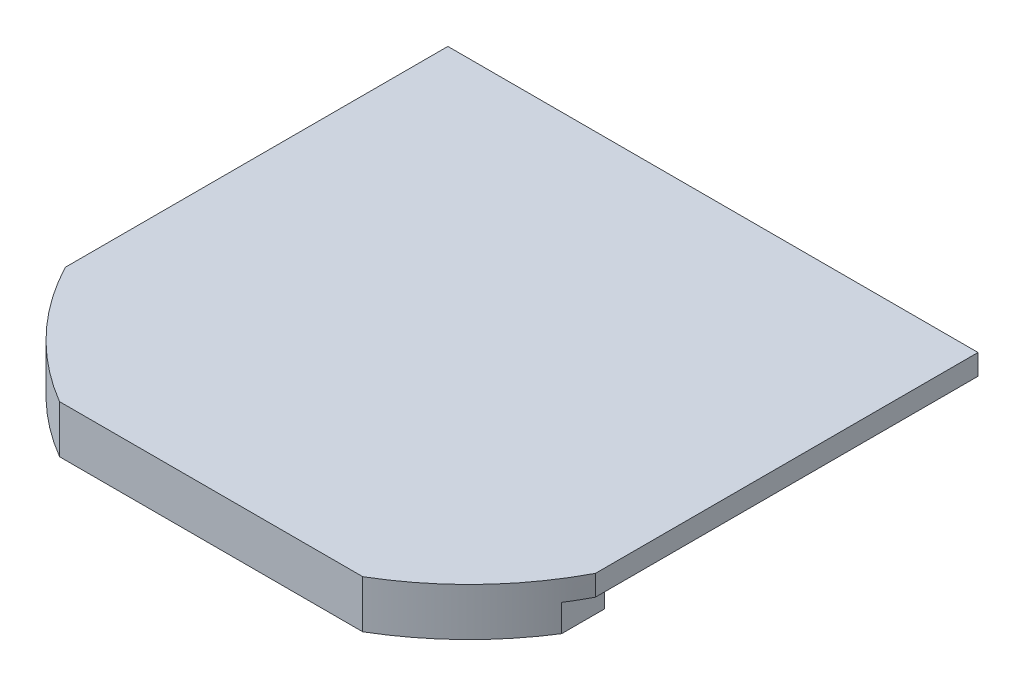
ISO-10303-21;
HEADER;
FILE_DESCRIPTION(('STEP AP214'),'2;1');
FILE_NAME('part.step','',(''),(''),'','','');
FILE_SCHEMA(('AUTOMOTIVE_DESIGN { 1 0 10303 214 1 1 1 1 }'));
ENDSEC;
DATA;
#1=APPLICATION_CONTEXT('core data for automotive mechanical design processes');
#2=APPLICATION_PROTOCOL_DEFINITION('international standard','automotive_design',2000,#1);
#3=PRODUCT_CONTEXT('',#1,'mechanical');
#4=PRODUCT('Part','Part','',(#3));
#5=PRODUCT_RELATED_PRODUCT_CATEGORY('part','',(#4));
#6=PRODUCT_DEFINITION_FORMATION('','',#4);
#7=PRODUCT_DEFINITION_CONTEXT('part definition',#1,'design');
#8=PRODUCT_DEFINITION('design','',#6,#7);
#9=PRODUCT_DEFINITION_SHAPE('','',#8);
#10=(LENGTH_UNIT() NAMED_UNIT(*) SI_UNIT(.MILLI.,.METRE.));
#11=(NAMED_UNIT(*) PLANE_ANGLE_UNIT() SI_UNIT($,.RADIAN.));
#12=(NAMED_UNIT(*) SI_UNIT($,.STERADIAN.) SOLID_ANGLE_UNIT());
#13=UNCERTAINTY_MEASURE_WITH_UNIT(LENGTH_MEASURE(1.E-05),#10,'distance_accuracy_value','');
#14=(GEOMETRIC_REPRESENTATION_CONTEXT(3) GLOBAL_UNCERTAINTY_ASSIGNED_CONTEXT((#13)) GLOBAL_UNIT_ASSIGNED_CONTEXT((#10,
#11,#12)) REPRESENTATION_CONTEXT('',''));
#15=CARTESIAN_POINT('',(0.,0.,0.));
#16=DIRECTION('',(0.,0.,1.));
#17=DIRECTION('',(1.,0.,0.));
#18=AXIS2_PLACEMENT_3D('',#15,#16,#17);
#19=CARTESIAN_POINT('',(-24.5,0.33,1.54680571791022));
#20=DIRECTION('',(1.,0.,0.));
#21=DIRECTION('',(0.,0.,-1.));
#22=AXIS2_PLACEMENT_3D('',#19,#20,#21);
#23=PLANE('',#22);
#24=DIRECTION('',(0.,0.,-1.));
#25=VECTOR('',#24,1.);
#26=CARTESIAN_POINT('',(-24.5,0.329999999999997,-9.12659714104491));
#27=LINE('',#26,#25);
#28=CARTESIAN_POINT('',(-24.5,0.329999999999997,5.71612064918291));
#29=VERTEX_POINT('',#28);
#30=CARTESIAN_POINT('',(-24.5,0.329999999999997,1.54680571791021));
#31=VERTEX_POINT('',#30);
#32=EDGE_CURVE('E168',#29,#31,#27,.T.);
#33=ORIENTED_EDGE('',*,*,#32,.T.);
#34=DIRECTION('',(0.,-1.,0.));
#35=VECTOR('',#34,1.);
#36=CARTESIAN_POINT('',(-24.5,0.33,1.54680571791021));
#37=LINE('',#36,#35);
#38=CARTESIAN_POINT('',(-24.5,-2.29999999999109,1.54680571791021));
#39=VERTEX_POINT('',#38);
#40=EDGE_CURVE('E252',#31,#39,#37,.T.);
#41=ORIENTED_EDGE('',*,*,#40,.T.);
#42=DIRECTION('',(0.,0.,-1.));
#43=VECTOR('',#42,1.);
#44=CARTESIAN_POINT('',(-24.5,-2.29999999999109,1.54680571791022));
#45=LINE('',#44,#43);
#46=CARTESIAN_POINT('',(-24.5,-2.29999999999109,5.71612064918291));
#47=VERTEX_POINT('',#46);
#48=EDGE_CURVE('E208',#47,#39,#45,.T.);
#49=ORIENTED_EDGE('',*,*,#48,.F.);
#50=DIRECTION('',(0.,-1.,0.));
#51=VECTOR('',#50,1.);
#52=CARTESIAN_POINT('',(-24.5,0.33,5.71612064918291));
#53=LINE('',#52,#51);
#54=EDGE_CURVE('E254',#29,#47,#53,.T.);
#55=ORIENTED_EDGE('',*,*,#54,.F.);
#56=EDGE_LOOP('',(#33,#41,#49,#55));
#57=FACE_BOUND('',#56,.T.);
#58=ADVANCED_FACE('F34',(#57),#23,.F.);
#59=CARTESIAN_POINT('',(24.5,0.33,5.71612064918292));
#60=DIRECTION('',(-1.,0.,0.));
#61=DIRECTION('',(0.,0.,1.));
#62=AXIS2_PLACEMENT_3D('',#59,#60,#61);
#63=PLANE('',#62);
#64=DIRECTION('',(0.,0.,1.));
#65=VECTOR('',#64,1.);
#66=CARTESIAN_POINT('',(24.5,0.329999999999997,-9.12659714104488));
#67=LINE('',#66,#65);
#68=CARTESIAN_POINT('',(24.5,0.329999999999997,1.54680571791023));
#69=VERTEX_POINT('',#68);
#70=CARTESIAN_POINT('',(24.5,0.329999999999997,5.71612064918292));
#71=VERTEX_POINT('',#70);
#72=EDGE_CURVE('E167',#69,#71,#67,.T.);
#73=ORIENTED_EDGE('',*,*,#72,.T.);
#74=DIRECTION('',(0.,-1.,0.));
#75=VECTOR('',#74,1.);
#76=CARTESIAN_POINT('',(24.5,0.33,5.71612064918292));
#77=LINE('',#76,#75);
#78=CARTESIAN_POINT('',(24.5,-2.29999999999109,5.71612064918292));
#79=VERTEX_POINT('',#78);
#80=EDGE_CURVE('E227',#71,#79,#77,.T.);
#81=ORIENTED_EDGE('',*,*,#80,.T.);
#82=DIRECTION('',(0.,0.,1.));
#83=VECTOR('',#82,1.);
#84=CARTESIAN_POINT('',(24.5,-2.29999999999109,5.71612064918292));
#85=LINE('',#84,#83);
#86=CARTESIAN_POINT('',(24.5,-2.29999999999109,1.54680571791023));
#87=VERTEX_POINT('',#86);
#88=EDGE_CURVE('E200',#87,#79,#85,.T.);
#89=ORIENTED_EDGE('',*,*,#88,.F.);
#90=DIRECTION('',(0.,-1.,0.));
#91=VECTOR('',#90,1.);
#92=CARTESIAN_POINT('',(24.5,0.33,1.54680571791023));
#93=LINE('',#92,#91);
#94=EDGE_CURVE('E232',#69,#87,#93,.T.);
#95=ORIENTED_EDGE('',*,*,#94,.F.);
#96=EDGE_LOOP('',(#73,#81,#89,#95));
#97=FACE_BOUND('',#96,.T.);
#98=ADVANCED_FACE('F261',(#97),#63,.F.);
#99=CARTESIAN_POINT('',(0.,0.33,-9.79999999999999));
#100=DIRECTION('',(0.,-1.,0.));
#101=DIRECTION('',(0.,0.,-1.));
#102=AXIS2_PLACEMENT_3D('',#99,#100,#101);
#103=CYLINDRICAL_SURFACE('',#102,27.);
#104=ORIENTED_EDGE('',*,*,#94,.T.);
#105=CARTESIAN_POINT('',(0.,-2.3,-9.79999999999999));
#106=DIRECTION('',(0.,-1.,0.));
#107=DIRECTION('',(0.,0.,1.));
#108=AXIS2_PLACEMENT_3D('',#105,#106,#107);
#109=CIRCLE('',#108,27.);
#110=CARTESIAN_POINT('',(14.142135623731,-2.29999999999109,13.2));
#111=VERTEX_POINT('',#110);
#112=EDGE_CURVE('E209',#87,#111,#109,.T.);
#113=ORIENTED_EDGE('',*,*,#112,.T.);
#114=DIRECTION('',(0.,-1.,0.));
#115=VECTOR('',#114,1.);
#116=CARTESIAN_POINT('',(14.142135623731,0.33,13.2));
#117=LINE('',#116,#115);
#118=CARTESIAN_POINT('',(14.142135623731,0.33,13.2));
#119=VERTEX_POINT('',#118);
#120=EDGE_CURVE('E11',#119,#111,#117,.T.);
#121=ORIENTED_EDGE('',*,*,#120,.F.);
#122=CARTESIAN_POINT('',(0.,0.33,-9.79999999999999));
#123=DIRECTION('',(0.,-1.,0.));
#124=DIRECTION('',(0.,0.,1.));
#125=AXIS2_PLACEMENT_3D('',#122,#123,#124);
#126=CIRCLE('',#125,27.);
#127=EDGE_CURVE('E203',#69,#119,#126,.T.);
#128=ORIENTED_EDGE('',*,*,#127,.F.);
#129=EDGE_LOOP('',(#104,#113,#121,#128));
#130=FACE_BOUND('',#129,.T.);
#131=ADVANCED_FACE('F36',(#130),#103,.F.);
#132=CARTESIAN_POINT('',(14.142135623731,0.33,13.2));
#133=DIRECTION('',(0.,0.,1.));
#134=DIRECTION('',(1.,0.,0.));
#135=AXIS2_PLACEMENT_3D('',#132,#133,#134);
#136=PLANE('',#135);
#137=ORIENTED_EDGE('',*,*,#120,.T.);
#138=DIRECTION('',(-1.,0.,0.));
#139=VECTOR('',#138,1.);
#140=CARTESIAN_POINT('',(14.142135623731,-2.3,13.2));
#141=LINE('',#140,#139);
#142=CARTESIAN_POINT('',(-14.142135623731,-2.29999999999109,13.2));
#143=VERTEX_POINT('',#142);
#144=EDGE_CURVE('E133',#111,#143,#141,.T.);
#145=ORIENTED_EDGE('',*,*,#144,.T.);
#146=DIRECTION('',(0.,-1.,0.));
#147=VECTOR('',#146,1.);
#148=CARTESIAN_POINT('',(-14.142135623731,0.33,13.2));
#149=LINE('',#148,#147);
#150=CARTESIAN_POINT('',(-14.142135623731,0.33,13.2));
#151=VERTEX_POINT('',#150);
#152=EDGE_CURVE('E43',#151,#143,#149,.T.);
#153=ORIENTED_EDGE('',*,*,#152,.F.);
#154=DIRECTION('',(-1.,0.,0.));
#155=VECTOR('',#154,1.);
#156=CARTESIAN_POINT('',(14.142135623731,0.33,13.2));
#157=LINE('',#156,#155);
#158=EDGE_CURVE('E54',#119,#151,#157,.T.);
#159=ORIENTED_EDGE('',*,*,#158,.F.);
#160=EDGE_LOOP('',(#137,#145,#153,#159));
#161=FACE_BOUND('',#160,.T.);
#162=ADVANCED_FACE('F244',(#161),#136,.F.);
#163=CARTESIAN_POINT('',(0.,0.33,-9.79999999999999));
#164=DIRECTION('',(0.,-1.,0.));
#165=DIRECTION('',(0.,0.,-1.));
#166=AXIS2_PLACEMENT_3D('',#163,#164,#165);
#167=CYLINDRICAL_SURFACE('',#166,27.);
#168=ORIENTED_EDGE('',*,*,#152,.T.);
#169=CARTESIAN_POINT('',(0.,-2.29999999999109,-9.79999999999999));
#170=DIRECTION('',(0.,1.,0.));
#171=DIRECTION('',(0.,0.,1.));
#172=AXIS2_PLACEMENT_3D('',#169,#170,#171);
#173=CIRCLE('',#172,27.);
#174=EDGE_CURVE('E205',#39,#143,#173,.T.);
#175=ORIENTED_EDGE('',*,*,#174,.F.);
#176=ORIENTED_EDGE('',*,*,#40,.F.);
#177=CARTESIAN_POINT('',(0.,0.33,-9.79999999999999));
#178=DIRECTION('',(0.,-1.,0.));
#179=DIRECTION('',(0.,0.,1.));
#180=AXIS2_PLACEMENT_3D('',#177,#178,#179);
#181=CIRCLE('',#180,27.);
#182=EDGE_CURVE('E224',#151,#31,#181,.T.);
#183=ORIENTED_EDGE('',*,*,#182,.F.);
#184=EDGE_LOOP('',(#168,#175,#176,#183));
#185=FACE_BOUND('',#184,.T.);
#186=ADVANCED_FACE('F251',(#185),#167,.F.);
#187=CARTESIAN_POINT('',(0.,0.33,-9.79999999999999));
#188=DIRECTION('',(0.,-1.,0.));
#189=DIRECTION('',(0.,0.,-1.));
#190=AXIS2_PLACEMENT_3D('',#187,#188,#189);
#191=CYLINDRICAL_SURFACE('',#190,29.);
#192=CARTESIAN_POINT('',(0.,2.33,-9.79999999999999));
#193=DIRECTION('',(0.,1.,0.));
#194=DIRECTION('',(0.,0.,1.));
#195=AXIS2_PLACEMENT_3D('',#192,#193,#194);
#196=CIRCLE('',#195,29.);
#197=CARTESIAN_POINT('',(-25.7,2.33,3.63540099885372));
#198=VERTEX_POINT('',#197);
#199=CARTESIAN_POINT('',(-14.6969384566991,2.33,15.2));
#200=VERTEX_POINT('',#199);
#201=EDGE_CURVE('E166',#198,#200,#196,.T.);
#202=ORIENTED_EDGE('',*,*,#201,.F.);
#203=DIRECTION('',(0.,1.,0.));
#204=VECTOR('',#203,1.);
#205=CARTESIAN_POINT('',(-25.7,-64.2934882390701,3.63540099885372));
#206=LINE('',#205,#204);
#207=CARTESIAN_POINT('',(-25.7,0.329999999999997,3.63540099885372));
#208=VERTEX_POINT('',#207);
#209=EDGE_CURVE('E158',#208,#198,#206,.T.);
#210=ORIENTED_EDGE('',*,*,#209,.F.);
#211=CARTESIAN_POINT('',(0.,0.329999999999997,-9.79999999999999));
#212=DIRECTION('',(0.,1.,0.));
#213=DIRECTION('',(0.,0.,1.));
#214=AXIS2_PLACEMENT_3D('',#211,#212,#213);
#215=CIRCLE('',#214,29.);
#216=EDGE_CURVE('E170',#29,#208,#215,.F.);
#217=ORIENTED_EDGE('',*,*,#216,.F.);
#218=ORIENTED_EDGE('',*,*,#54,.T.);
#219=CARTESIAN_POINT('',(0.,-2.29999999999109,-9.79999999999999));
#220=DIRECTION('',(0.,1.,0.));
#221=DIRECTION('',(0.,0.,1.));
#222=AXIS2_PLACEMENT_3D('',#219,#220,#221);
#223=CIRCLE('',#222,29.);
#224=CARTESIAN_POINT('',(-14.6969384566991,-2.29999999999109,15.2));
#225=VERTEX_POINT('',#224);
#226=EDGE_CURVE('E218',#225,#47,#223,.F.);
#227=ORIENTED_EDGE('',*,*,#226,.F.);
#228=DIRECTION('',(0.,-1.,0.));
#229=VECTOR('',#228,1.);
#230=CARTESIAN_POINT('',(-14.6969384566991,0.33,15.2));
#231=LINE('',#230,#229);
#232=EDGE_CURVE('E197',#200,#225,#231,.T.);
#233=ORIENTED_EDGE('',*,*,#232,.F.);
#234=EDGE_LOOP('',(#202,#210,#217,#218,#227,#233));
#235=FACE_BOUND('',#234,.T.);
#236=ADVANCED_FACE('F194',(#235),#191,.T.);
#237=CARTESIAN_POINT('',(14.6969384566991,0.33,15.2));
#238=DIRECTION('',(0.,0.,-1.));
#239=DIRECTION('',(-1.,0.,0.));
#240=AXIS2_PLACEMENT_3D('',#237,#238,#239);
#241=PLANE('',#240);
#242=ORIENTED_EDGE('',*,*,#232,.T.);
#243=DIRECTION('',(-1.,0.,0.));
#244=VECTOR('',#243,1.);
#245=CARTESIAN_POINT('',(14.6969384566991,-2.29999999999109,15.2));
#246=LINE('',#245,#244);
#247=CARTESIAN_POINT('',(14.6969384566991,-2.29999999999109,15.2));
#248=VERTEX_POINT('',#247);
#249=EDGE_CURVE('E215',#248,#225,#246,.T.);
#250=ORIENTED_EDGE('',*,*,#249,.F.);
#251=DIRECTION('',(0.,-1.,0.));
#252=VECTOR('',#251,1.);
#253=CARTESIAN_POINT('',(14.6969384566991,0.33,15.2));
#254=LINE('',#253,#252);
#255=CARTESIAN_POINT('',(14.6969384566991,2.33,15.2));
#256=VERTEX_POINT('',#255);
#257=EDGE_CURVE('E257',#256,#248,#254,.T.);
#258=ORIENTED_EDGE('',*,*,#257,.F.);
#259=DIRECTION('',(1.,0.,0.));
#260=VECTOR('',#259,1.);
#261=CARTESIAN_POINT('',(-14.6969384566991,2.33,15.2));
#262=LINE('',#261,#260);
#263=EDGE_CURVE('E131',#200,#256,#262,.T.);
#264=ORIENTED_EDGE('',*,*,#263,.F.);
#265=EDGE_LOOP('',(#242,#250,#258,#264));
#266=FACE_BOUND('',#265,.T.);
#267=ADVANCED_FACE('F263',(#266),#241,.F.);
#268=CARTESIAN_POINT('',(0.,0.33,-9.79999999999999));
#269=DIRECTION('',(0.,-1.,0.));
#270=DIRECTION('',(0.,0.,-1.));
#271=AXIS2_PLACEMENT_3D('',#268,#269,#270);
#272=CYLINDRICAL_SURFACE('',#271,29.);
#273=ORIENTED_EDGE('',*,*,#257,.T.);
#274=CARTESIAN_POINT('',(0.,-2.29999999999109,-9.79999999999999));
#275=DIRECTION('',(0.,1.,0.));
#276=DIRECTION('',(0.,0.,1.));
#277=AXIS2_PLACEMENT_3D('',#274,#275,#276);
#278=CIRCLE('',#277,29.);
#279=EDGE_CURVE('E204',#79,#248,#278,.F.);
#280=ORIENTED_EDGE('',*,*,#279,.F.);
#281=ORIENTED_EDGE('',*,*,#80,.F.);
#282=CARTESIAN_POINT('',(0.,0.329999999999997,-9.79999999999999));
#283=DIRECTION('',(0.,1.,0.));
#284=DIRECTION('',(0.,0.,1.));
#285=AXIS2_PLACEMENT_3D('',#282,#283,#284);
#286=CIRCLE('',#285,29.);
#287=CARTESIAN_POINT('',(25.7,0.329999999999997,3.63540099885376));
#288=VERTEX_POINT('',#287);
#289=EDGE_CURVE('E140',#288,#71,#286,.F.);
#290=ORIENTED_EDGE('',*,*,#289,.F.);
#291=DIRECTION('',(0.,1.,0.));
#292=VECTOR('',#291,1.);
#293=CARTESIAN_POINT('',(25.7,-64.2934882390701,3.63540099885376));
#294=LINE('',#293,#292);
#295=CARTESIAN_POINT('',(25.7,2.33,3.63540099885376));
#296=VERTEX_POINT('',#295);
#297=EDGE_CURVE('E137',#288,#296,#294,.T.);
#298=ORIENTED_EDGE('',*,*,#297,.T.);
#299=CARTESIAN_POINT('',(0.,2.33,-9.79999999999999));
#300=DIRECTION('',(0.,1.,0.));
#301=DIRECTION('',(0.,0.,1.));
#302=AXIS2_PLACEMENT_3D('',#299,#300,#301);
#303=CIRCLE('',#302,29.);
#304=EDGE_CURVE('E123',#256,#296,#303,.T.);
#305=ORIENTED_EDGE('',*,*,#304,.F.);
#306=EDGE_LOOP('',(#273,#280,#281,#290,#298,#305));
#307=FACE_BOUND('',#306,.T.);
#308=ADVANCED_FACE('F138',(#307),#272,.T.);
#309=CARTESIAN_POINT('',(0.,-2.3,-9.79999999999999));
#310=DIRECTION('',(0.,1.,0.));
#311=DIRECTION('',(0.,0.,1.));
#312=AXIS2_PLACEMENT_3D('',#309,#310,#311);
#313=PLANE('',#312);
#314=ORIENTED_EDGE('',*,*,#48,.T.);
#315=ORIENTED_EDGE('',*,*,#174,.T.);
#316=ORIENTED_EDGE('',*,*,#144,.F.);
#317=ORIENTED_EDGE('',*,*,#112,.F.);
#318=ORIENTED_EDGE('',*,*,#88,.T.);
#319=ORIENTED_EDGE('',*,*,#279,.T.);
#320=ORIENTED_EDGE('',*,*,#249,.T.);
#321=ORIENTED_EDGE('',*,*,#226,.T.);
#322=EDGE_LOOP('',(#314,#315,#316,#317,#318,#319,#320,#321));
#323=FACE_BOUND('',#322,.T.);
#324=ADVANCED_FACE('F247',(#323),#313,.F.);
#325=CARTESIAN_POINT('',(0.,0.33,-9.79999999999999));
#326=DIRECTION('',(0.,1.,0.));
#327=DIRECTION('',(0.,0.,1.));
#328=AXIS2_PLACEMENT_3D('',#325,#326,#327);
#329=PLANE('',#328);
#330=ORIENTED_EDGE('',*,*,#182,.T.);
#331=ORIENTED_EDGE('',*,*,#32,.F.);
#332=ORIENTED_EDGE('',*,*,#216,.T.);
#333=DIRECTION('',(0.,0.,1.));
#334=VECTOR('',#333,1.);
#335=CARTESIAN_POINT('',(-25.7,0.329999999999997,-9.12659714104488));
#336=LINE('',#335,#334);
#337=CARTESIAN_POINT('',(-25.7,0.329999999999997,-33.4531942820898));
#338=VERTEX_POINT('',#337);
#339=EDGE_CURVE('E175',#338,#208,#336,.T.);
#340=ORIENTED_EDGE('',*,*,#339,.F.);
#341=DIRECTION('',(-1.,0.,0.));
#342=VECTOR('',#341,1.);
#343=CARTESIAN_POINT('',(-55.1914118637726,0.329999999999997,-33.4531942820898));
#344=LINE('',#343,#342);
#345=CARTESIAN_POINT('',(25.7,0.329999999999997,-33.4531942820898));
#346=VERTEX_POINT('',#345);
#347=EDGE_CURVE('E178',#346,#338,#344,.T.);
#348=ORIENTED_EDGE('',*,*,#347,.F.);
#349=DIRECTION('',(0.,0.,1.));
#350=VECTOR('',#349,1.);
#351=CARTESIAN_POINT('',(25.7,0.329999999999997,-9.12659714104483));
#352=LINE('',#351,#350);
#353=EDGE_CURVE('E161',#346,#288,#352,.T.);
#354=ORIENTED_EDGE('',*,*,#353,.T.);
#355=ORIENTED_EDGE('',*,*,#289,.T.);
#356=ORIENTED_EDGE('',*,*,#72,.F.);
#357=ORIENTED_EDGE('',*,*,#127,.T.);
#358=ORIENTED_EDGE('',*,*,#158,.T.);
#359=EDGE_LOOP('',(#330,#331,#332,#340,#348,#354,#355,#356,#357,#358));
#360=FACE_BOUND('',#359,.T.);
#361=ADVANCED_FACE('F183',(#360),#329,.F.);
#362=CARTESIAN_POINT('',(0.,2.33,-9.79999999999999));
#363=DIRECTION('',(0.,1.,0.));
#364=DIRECTION('',(0.,0.,1.));
#365=AXIS2_PLACEMENT_3D('',#362,#363,#364);
#366=PLANE('',#365);
#367=ORIENTED_EDGE('',*,*,#201,.T.);
#368=ORIENTED_EDGE('',*,*,#263,.T.);
#369=ORIENTED_EDGE('',*,*,#304,.T.);
#370=DIRECTION('',(0.,0.,-1.));
#371=VECTOR('',#370,1.);
#372=CARTESIAN_POINT('',(25.7,2.33,-9.12659714104483));
#373=LINE('',#372,#371);
#374=CARTESIAN_POINT('',(25.7,2.33,-33.4531942820898));
#375=VERTEX_POINT('',#374);
#376=EDGE_CURVE('E129',#296,#375,#373,.T.);
#377=ORIENTED_EDGE('',*,*,#376,.T.);
#378=DIRECTION('',(1.,0.,0.));
#379=VECTOR('',#378,1.);
#380=CARTESIAN_POINT('',(-55.1914118637726,2.33,-33.4531942820898));
#381=LINE('',#380,#379);
#382=CARTESIAN_POINT('',(-25.7,2.33,-33.4531942820898));
#383=VERTEX_POINT('',#382);
#384=EDGE_CURVE('E149',#383,#375,#381,.T.);
#385=ORIENTED_EDGE('',*,*,#384,.F.);
#386=DIRECTION('',(0.,0.,-1.));
#387=VECTOR('',#386,1.);
#388=CARTESIAN_POINT('',(-25.7,2.33,-9.12659714104488));
#389=LINE('',#388,#387);
#390=EDGE_CURVE('E144',#198,#383,#389,.T.);
#391=ORIENTED_EDGE('',*,*,#390,.F.);
#392=EDGE_LOOP('',(#367,#368,#369,#377,#385,#391));
#393=FACE_BOUND('',#392,.T.);
#394=ADVANCED_FACE('F126',(#393),#366,.T.);
#395=CARTESIAN_POINT('',(-25.7,-64.2934882390701,-9.12659714104488));
#396=DIRECTION('',(1.,0.,0.));
#397=DIRECTION('',(0.,0.,-1.));
#398=AXIS2_PLACEMENT_3D('',#395,#396,#397);
#399=PLANE('',#398);
#400=DIRECTION('',(0.,1.,0.));
#401=VECTOR('',#400,1.);
#402=CARTESIAN_POINT('',(-25.7,-64.2934882390701,-33.4531942820898));
#403=LINE('',#402,#401);
#404=EDGE_CURVE('E162',#338,#383,#403,.T.);
#405=ORIENTED_EDGE('',*,*,#404,.F.);
#406=ORIENTED_EDGE('',*,*,#339,.T.);
#407=ORIENTED_EDGE('',*,*,#209,.T.);
#408=ORIENTED_EDGE('',*,*,#390,.T.);
#409=EDGE_LOOP('',(#405,#406,#407,#408));
#410=FACE_BOUND('',#409,.T.);
#411=ADVANCED_FACE('F190',(#410),#399,.F.);
#412=CARTESIAN_POINT('',(-55.1914118637726,-64.2934882390701,-33.4531942820898));
#413=DIRECTION('',(0.,0.,1.));
#414=DIRECTION('',(1.,0.,0.));
#415=AXIS2_PLACEMENT_3D('',#412,#413,#414);
#416=PLANE('',#415);
#417=DIRECTION('',(0.,1.,0.));
#418=VECTOR('',#417,1.);
#419=CARTESIAN_POINT('',(25.7,-64.2934882390701,-33.4531942820898));
#420=LINE('',#419,#418);
#421=EDGE_CURVE('E143',#346,#375,#420,.T.);
#422=ORIENTED_EDGE('',*,*,#421,.F.);
#423=ORIENTED_EDGE('',*,*,#347,.T.);
#424=ORIENTED_EDGE('',*,*,#404,.T.);
#425=ORIENTED_EDGE('',*,*,#384,.T.);
#426=EDGE_LOOP('',(#422,#423,#424,#425));
#427=FACE_BOUND('',#426,.T.);
#428=ADVANCED_FACE('F186',(#427),#416,.F.);
#429=CARTESIAN_POINT('',(25.7,-64.2934882390701,-9.12659714104483));
#430=DIRECTION('',(1.,0.,0.));
#431=DIRECTION('',(0.,0.,-1.));
#432=AXIS2_PLACEMENT_3D('',#429,#430,#431);
#433=PLANE('',#432);
#434=ORIENTED_EDGE('',*,*,#353,.F.);
#435=ORIENTED_EDGE('',*,*,#421,.T.);
#436=ORIENTED_EDGE('',*,*,#376,.F.);
#437=ORIENTED_EDGE('',*,*,#297,.F.);
#438=EDGE_LOOP('',(#434,#435,#436,#437));
#439=FACE_BOUND('',#438,.T.);
#440=ADVANCED_FACE('F146',(#439),#433,.T.);
#441=CLOSED_SHELL('',(#58,#98,#131,#162,#186,#236,#267,#308,#324,#361,#394,#411,#428,#440));
#442=MANIFOLD_SOLID_BREP('B2',#441);
#443=ADVANCED_BREP_SHAPE_REPRESENTATION('',(#18,#442),#14);
#444=SHAPE_DEFINITION_REPRESENTATION(#9,#443);
ENDSEC;
END-ISO-10303-21;
